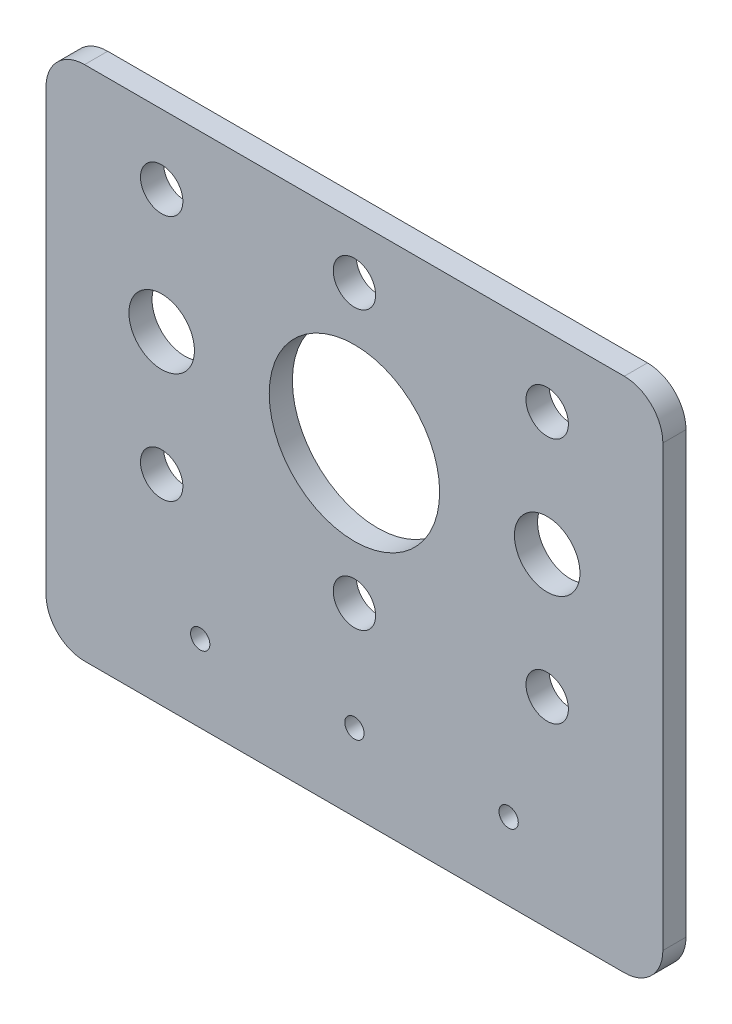
ISO-10303-21;
HEADER;
FILE_DESCRIPTION(('STEP AP214'),'2;1');
FILE_NAME('part.step','',(''),(''),'','','');
FILE_SCHEMA(('AUTOMOTIVE_DESIGN { 1 0 10303 214 1 1 1 1 }'));
ENDSEC;
DATA;
#1=APPLICATION_CONTEXT('core data for automotive mechanical design processes');
#2=APPLICATION_PROTOCOL_DEFINITION('international standard','automotive_design',2000,#1);
#3=PRODUCT_CONTEXT('',#1,'mechanical');
#4=PRODUCT('Part','Part','',(#3));
#5=PRODUCT_RELATED_PRODUCT_CATEGORY('part','',(#4));
#6=PRODUCT_DEFINITION_FORMATION('','',#4);
#7=PRODUCT_DEFINITION_CONTEXT('part definition',#1,'design');
#8=PRODUCT_DEFINITION('design','',#6,#7);
#9=PRODUCT_DEFINITION_SHAPE('','',#8);
#10=(LENGTH_UNIT() NAMED_UNIT(*) SI_UNIT(.MILLI.,.METRE.));
#11=(NAMED_UNIT(*) PLANE_ANGLE_UNIT() SI_UNIT($,.RADIAN.));
#12=(NAMED_UNIT(*) SI_UNIT($,.STERADIAN.) SOLID_ANGLE_UNIT());
#13=UNCERTAINTY_MEASURE_WITH_UNIT(LENGTH_MEASURE(1.E-05),#10,'distance_accuracy_value','');
#14=(GEOMETRIC_REPRESENTATION_CONTEXT(3) GLOBAL_UNCERTAINTY_ASSIGNED_CONTEXT((#13)) GLOBAL_UNIT_ASSIGNED_CONTEXT((#10,
#11,#12)) REPRESENTATION_CONTEXT('',''));
#15=CARTESIAN_POINT('',(0.,0.,0.));
#16=DIRECTION('',(0.,0.,1.));
#17=DIRECTION('',(1.,0.,0.));
#18=AXIS2_PLACEMENT_3D('',#15,#16,#17);
#19=CARTESIAN_POINT('',(-35.,-37.,3.));
#20=DIRECTION('',(0.,0.,1.));
#21=DIRECTION('',(1.,0.,0.));
#22=AXIS2_PLACEMENT_3D('',#19,#20,#21);
#23=PLANE('',#22);
#24=CARTESIAN_POINT('',(-25.,0.,3.));
#25=DIRECTION('',(0.,0.,1.));
#26=DIRECTION('',(1.,0.,0.));
#27=AXIS2_PLACEMENT_3D('',#24,#25,#26);
#28=CIRCLE('',#27,4.25);
#29=CARTESIAN_POINT('',(-20.75,0.,3.));
#30=VERTEX_POINT('',#29);
#31=EDGE_CURVE('E285',#30,#30,#28,.T.);
#32=ORIENTED_EDGE('',*,*,#31,.F.);
#33=EDGE_LOOP('',(#32));
#34=FACE_BOUND('',#33,.T.);
#35=CARTESIAN_POINT('',(-20.,-32.,3.));
#36=DIRECTION('',(0.,0.,1.));
#37=DIRECTION('',(1.,0.,0.));
#38=AXIS2_PLACEMENT_3D('',#35,#36,#37);
#39=CIRCLE('',#38,1.25);
#40=CARTESIAN_POINT('',(-18.75,-32.,3.));
#41=VERTEX_POINT('',#40);
#42=EDGE_CURVE('E269',#41,#41,#39,.T.);
#43=ORIENTED_EDGE('',*,*,#42,.F.);
#44=EDGE_LOOP('',(#43));
#45=FACE_BOUND('',#44,.T.);
#46=CARTESIAN_POINT('',(25.,16.,3.));
#47=DIRECTION('',(0.,0.,1.));
#48=DIRECTION('',(-1.,0.,0.));
#49=AXIS2_PLACEMENT_3D('',#46,#47,#48);
#50=CIRCLE('',#49,2.75);
#51=CARTESIAN_POINT('',(22.25,16.,3.));
#52=VERTEX_POINT('',#51);
#53=EDGE_CURVE('E253',#52,#52,#50,.T.);
#54=ORIENTED_EDGE('',*,*,#53,.F.);
#55=EDGE_LOOP('',(#54));
#56=FACE_BOUND('',#55,.T.);
#57=CARTESIAN_POINT('',(-25.,-16.,3.));
#58=DIRECTION('',(0.,0.,1.));
#59=DIRECTION('',(1.,0.,0.));
#60=AXIS2_PLACEMENT_3D('',#57,#58,#59);
#61=CIRCLE('',#60,2.75);
#62=CARTESIAN_POINT('',(-22.25,-16.,3.));
#63=VERTEX_POINT('',#62);
#64=EDGE_CURVE('E237',#63,#63,#61,.T.);
#65=ORIENTED_EDGE('',*,*,#64,.F.);
#66=EDGE_LOOP('',(#65));
#67=FACE_BOUND('',#66,.T.);
#68=CARTESIAN_POINT('',(0.,-18.,3.));
#69=DIRECTION('',(0.,0.,1.));
#70=DIRECTION('',(1.,0.,0.));
#71=AXIS2_PLACEMENT_3D('',#68,#69,#70);
#72=CIRCLE('',#71,2.75);
#73=CARTESIAN_POINT('',(2.75,-18.,3.));
#74=VERTEX_POINT('',#73);
#75=EDGE_CURVE('E221',#74,#74,#72,.T.);
#76=ORIENTED_EDGE('',*,*,#75,.F.);
#77=EDGE_LOOP('',(#76));
#78=FACE_BOUND('',#77,.T.);
#79=CARTESIAN_POINT('',(0.,0.,3.));
#80=DIRECTION('',(0.,0.,1.));
#81=DIRECTION('',(1.,0.,0.));
#82=AXIS2_PLACEMENT_3D('',#79,#80,#81);
#83=CIRCLE('',#82,11.05);
#84=CARTESIAN_POINT('',(11.05,0.,3.));
#85=VERTEX_POINT('',#84);
#86=EDGE_CURVE('E146',#85,#85,#83,.T.);
#87=ORIENTED_EDGE('',*,*,#86,.F.);
#88=EDGE_LOOP('',(#87));
#89=FACE_BOUND('',#88,.T.);
#90=CARTESIAN_POINT('',(-35.,-37.,3.));
#91=DIRECTION('',(0.,0.,1.));
#92=DIRECTION('',(1.,0.,0.));
#93=AXIS2_PLACEMENT_3D('',#90,#91,#92);
#94=CIRCLE('',#93,5.);
#95=CARTESIAN_POINT('',(-40.,-37.,3.));
#96=VERTEX_POINT('',#95);
#97=CARTESIAN_POINT('',(-35.,-42.,3.));
#98=VERTEX_POINT('',#97);
#99=EDGE_CURVE('E164',#96,#98,#94,.T.);
#100=ORIENTED_EDGE('',*,*,#99,.T.);
#101=DIRECTION('',(1.,0.,0.));
#102=VECTOR('',#101,1.);
#103=CARTESIAN_POINT('',(-35.,-42.,3.));
#104=LINE('',#103,#102);
#105=CARTESIAN_POINT('',(35.,-42.,3.));
#106=VERTEX_POINT('',#105);
#107=EDGE_CURVE('E100',#98,#106,#104,.T.);
#108=ORIENTED_EDGE('',*,*,#107,.T.);
#109=CARTESIAN_POINT('',(35.,-37.,3.));
#110=DIRECTION('',(0.,0.,1.));
#111=DIRECTION('',(1.,0.,0.));
#112=AXIS2_PLACEMENT_3D('',#109,#110,#111);
#113=CIRCLE('',#112,5.);
#114=CARTESIAN_POINT('',(40.,-37.,3.));
#115=VERTEX_POINT('',#114);
#116=EDGE_CURVE('E185',#106,#115,#113,.T.);
#117=ORIENTED_EDGE('',*,*,#116,.T.);
#118=DIRECTION('',(0.,1.,0.));
#119=VECTOR('',#118,1.);
#120=CARTESIAN_POINT('',(40.,20.,3.));
#121=LINE('',#120,#119);
#122=CARTESIAN_POINT('',(40.,20.,3.));
#123=VERTEX_POINT('',#122);
#124=EDGE_CURVE('E199',#115,#123,#121,.T.);
#125=ORIENTED_EDGE('',*,*,#124,.T.);
#126=CARTESIAN_POINT('',(35.,20.,3.));
#127=DIRECTION('',(0.,0.,1.));
#128=DIRECTION('',(1.,0.,0.));
#129=AXIS2_PLACEMENT_3D('',#126,#127,#128);
#130=CIRCLE('',#129,5.);
#131=CARTESIAN_POINT('',(35.,25.,3.));
#132=VERTEX_POINT('',#131);
#133=EDGE_CURVE('E119',#123,#132,#130,.T.);
#134=ORIENTED_EDGE('',*,*,#133,.T.);
#135=DIRECTION('',(-1.,0.,0.));
#136=VECTOR('',#135,1.);
#137=CARTESIAN_POINT('',(-35.,25.,3.));
#138=LINE('',#137,#136);
#139=CARTESIAN_POINT('',(-35.,25.,3.));
#140=VERTEX_POINT('',#139);
#141=EDGE_CURVE('E113',#132,#140,#138,.T.);
#142=ORIENTED_EDGE('',*,*,#141,.T.);
#143=CARTESIAN_POINT('',(-35.,20.,3.));
#144=DIRECTION('',(0.,0.,1.));
#145=DIRECTION('',(1.,0.,0.));
#146=AXIS2_PLACEMENT_3D('',#143,#144,#145);
#147=CIRCLE('',#146,5.);
#148=CARTESIAN_POINT('',(-40.,20.,3.));
#149=VERTEX_POINT('',#148);
#150=EDGE_CURVE('E117',#140,#149,#147,.T.);
#151=ORIENTED_EDGE('',*,*,#150,.T.);
#152=DIRECTION('',(0.,-1.,0.));
#153=VECTOR('',#152,1.);
#154=CARTESIAN_POINT('',(-40.,20.,3.));
#155=LINE('',#154,#153);
#156=EDGE_CURVE('E57',#149,#96,#155,.T.);
#157=ORIENTED_EDGE('',*,*,#156,.T.);
#158=EDGE_LOOP('',(#100,#108,#117,#125,#134,#142,#151,#157));
#159=FACE_BOUND('',#158,.T.);
#160=CARTESIAN_POINT('',(0.,18.,3.));
#161=DIRECTION('',(0.,0.,1.));
#162=DIRECTION('',(1.,0.,0.));
#163=AXIS2_PLACEMENT_3D('',#160,#161,#162);
#164=CIRCLE('',#163,2.75);
#165=CARTESIAN_POINT('',(2.75,18.,3.));
#166=VERTEX_POINT('',#165);
#167=EDGE_CURVE('E213',#166,#166,#164,.T.);
#168=ORIENTED_EDGE('',*,*,#167,.F.);
#169=EDGE_LOOP('',(#168));
#170=FACE_BOUND('',#169,.T.);
#171=CARTESIAN_POINT('',(-25.,16.,3.));
#172=DIRECTION('',(0.,0.,1.));
#173=DIRECTION('',(1.,0.,0.));
#174=AXIS2_PLACEMENT_3D('',#171,#172,#173);
#175=CIRCLE('',#174,2.75);
#176=CARTESIAN_POINT('',(-22.25,16.,3.));
#177=VERTEX_POINT('',#176);
#178=EDGE_CURVE('E229',#177,#177,#175,.T.);
#179=ORIENTED_EDGE('',*,*,#178,.F.);
#180=EDGE_LOOP('',(#179));
#181=FACE_BOUND('',#180,.T.);
#182=CARTESIAN_POINT('',(25.,-16.,3.));
#183=DIRECTION('',(0.,0.,1.));
#184=DIRECTION('',(-1.,0.,0.));
#185=AXIS2_PLACEMENT_3D('',#182,#183,#184);
#186=CIRCLE('',#185,2.75);
#187=CARTESIAN_POINT('',(22.25,-16.,3.));
#188=VERTEX_POINT('',#187);
#189=EDGE_CURVE('E245',#188,#188,#186,.T.);
#190=ORIENTED_EDGE('',*,*,#189,.F.);
#191=EDGE_LOOP('',(#190));
#192=FACE_BOUND('',#191,.T.);
#193=CARTESIAN_POINT('',(0.,-32.,3.));
#194=DIRECTION('',(0.,0.,1.));
#195=DIRECTION('',(1.,0.,0.));
#196=AXIS2_PLACEMENT_3D('',#193,#194,#195);
#197=CIRCLE('',#196,1.25);
#198=CARTESIAN_POINT('',(1.25,-32.,3.));
#199=VERTEX_POINT('',#198);
#200=EDGE_CURVE('E261',#199,#199,#197,.T.);
#201=ORIENTED_EDGE('',*,*,#200,.F.);
#202=EDGE_LOOP('',(#201));
#203=FACE_BOUND('',#202,.T.);
#204=CARTESIAN_POINT('',(20.,-32.,3.));
#205=DIRECTION('',(0.,0.,1.));
#206=DIRECTION('',(1.,0.,0.));
#207=AXIS2_PLACEMENT_3D('',#204,#205,#206);
#208=CIRCLE('',#207,1.25);
#209=CARTESIAN_POINT('',(21.25,-32.,3.));
#210=VERTEX_POINT('',#209);
#211=EDGE_CURVE('E277',#210,#210,#208,.T.);
#212=ORIENTED_EDGE('',*,*,#211,.F.);
#213=EDGE_LOOP('',(#212));
#214=FACE_BOUND('',#213,.T.);
#215=CARTESIAN_POINT('',(25.,0.,3.));
#216=DIRECTION('',(0.,0.,1.));
#217=DIRECTION('',(-1.,0.,0.));
#218=AXIS2_PLACEMENT_3D('',#215,#216,#217);
#219=CIRCLE('',#218,4.25);
#220=CARTESIAN_POINT('',(20.75,0.,3.));
#221=VERTEX_POINT('',#220);
#222=EDGE_CURVE('E293',#221,#221,#219,.T.);
#223=ORIENTED_EDGE('',*,*,#222,.F.);
#224=EDGE_LOOP('',(#223));
#225=FACE_BOUND('',#224,.T.);
#226=ADVANCED_FACE('F39',(#34,#45,#56,#67,#78,#89,#159,#170,#181,#192,#203,#214,#225),#23,.T.);
#227=CARTESIAN_POINT('',(-35.,-37.,0.));
#228=DIRECTION('',(0.,0.,1.));
#229=DIRECTION('',(1.,0.,0.));
#230=AXIS2_PLACEMENT_3D('',#227,#228,#229);
#231=PLANE('',#230);
#232=CARTESIAN_POINT('',(-35.,-37.,0.));
#233=DIRECTION('',(0.,0.,1.));
#234=DIRECTION('',(1.,0.,0.));
#235=AXIS2_PLACEMENT_3D('',#232,#233,#234);
#236=CIRCLE('',#235,5.);
#237=CARTESIAN_POINT('',(-40.,-37.,0.));
#238=VERTEX_POINT('',#237);
#239=CARTESIAN_POINT('',(-35.,-42.,0.));
#240=VERTEX_POINT('',#239);
#241=EDGE_CURVE('E141',#238,#240,#236,.T.);
#242=ORIENTED_EDGE('',*,*,#241,.F.);
#243=DIRECTION('',(0.,-1.,0.));
#244=VECTOR('',#243,1.);
#245=CARTESIAN_POINT('',(-40.,20.,0.));
#246=LINE('',#245,#244);
#247=CARTESIAN_POINT('',(-40.,20.,0.));
#248=VERTEX_POINT('',#247);
#249=EDGE_CURVE('E92',#248,#238,#246,.T.);
#250=ORIENTED_EDGE('',*,*,#249,.F.);
#251=CARTESIAN_POINT('',(-35.,20.,0.));
#252=DIRECTION('',(0.,0.,1.));
#253=DIRECTION('',(1.,0.,0.));
#254=AXIS2_PLACEMENT_3D('',#251,#252,#253);
#255=CIRCLE('',#254,5.);
#256=CARTESIAN_POINT('',(-35.,25.,0.));
#257=VERTEX_POINT('',#256);
#258=EDGE_CURVE('E86',#257,#248,#255,.T.);
#259=ORIENTED_EDGE('',*,*,#258,.F.);
#260=DIRECTION('',(-1.,0.,0.));
#261=VECTOR('',#260,1.);
#262=CARTESIAN_POINT('',(-35.,25.,0.));
#263=LINE('',#262,#261);
#264=CARTESIAN_POINT('',(35.,25.,0.));
#265=VERTEX_POINT('',#264);
#266=EDGE_CURVE('E128',#265,#257,#263,.T.);
#267=ORIENTED_EDGE('',*,*,#266,.F.);
#268=CARTESIAN_POINT('',(35.,20.,0.));
#269=DIRECTION('',(0.,0.,1.));
#270=DIRECTION('',(1.,0.,0.));
#271=AXIS2_PLACEMENT_3D('',#268,#269,#270);
#272=CIRCLE('',#271,5.);
#273=CARTESIAN_POINT('',(40.,20.,0.));
#274=VERTEX_POINT('',#273);
#275=EDGE_CURVE('E155',#274,#265,#272,.T.);
#276=ORIENTED_EDGE('',*,*,#275,.F.);
#277=DIRECTION('',(0.,1.,0.));
#278=VECTOR('',#277,1.);
#279=CARTESIAN_POINT('',(40.,20.,0.));
#280=LINE('',#279,#278);
#281=CARTESIAN_POINT('',(40.,-37.,0.));
#282=VERTEX_POINT('',#281);
#283=EDGE_CURVE('E152',#282,#274,#280,.T.);
#284=ORIENTED_EDGE('',*,*,#283,.F.);
#285=CARTESIAN_POINT('',(35.,-37.,0.));
#286=DIRECTION('',(0.,0.,1.));
#287=DIRECTION('',(1.,0.,0.));
#288=AXIS2_PLACEMENT_3D('',#285,#286,#287);
#289=CIRCLE('',#288,5.);
#290=CARTESIAN_POINT('',(35.,-42.,0.));
#291=VERTEX_POINT('',#290);
#292=EDGE_CURVE('E149',#291,#282,#289,.T.);
#293=ORIENTED_EDGE('',*,*,#292,.F.);
#294=DIRECTION('',(1.,0.,0.));
#295=VECTOR('',#294,1.);
#296=CARTESIAN_POINT('',(-35.,-42.,0.));
#297=LINE('',#296,#295);
#298=EDGE_CURVE('E145',#240,#291,#297,.T.);
#299=ORIENTED_EDGE('',*,*,#298,.F.);
#300=EDGE_LOOP('',(#242,#250,#259,#267,#276,#284,#293,#299));
#301=FACE_BOUND('',#300,.T.);
#302=CARTESIAN_POINT('',(0.,0.,0.));
#303=DIRECTION('',(0.,0.,1.));
#304=DIRECTION('',(1.,0.,0.));
#305=AXIS2_PLACEMENT_3D('',#302,#303,#304);
#306=CIRCLE('',#305,11.05);
#307=CARTESIAN_POINT('',(11.05,0.,0.));
#308=VERTEX_POINT('',#307);
#309=EDGE_CURVE('E209',#308,#308,#306,.T.);
#310=ORIENTED_EDGE('',*,*,#309,.T.);
#311=EDGE_LOOP('',(#310));
#312=FACE_BOUND('',#311,.T.);
#313=CARTESIAN_POINT('',(0.,18.,0.));
#314=DIRECTION('',(0.,0.,1.));
#315=DIRECTION('',(1.,0.,0.));
#316=AXIS2_PLACEMENT_3D('',#313,#314,#315);
#317=CIRCLE('',#316,2.75);
#318=CARTESIAN_POINT('',(2.75,18.,0.));
#319=VERTEX_POINT('',#318);
#320=EDGE_CURVE('E217',#319,#319,#317,.T.);
#321=ORIENTED_EDGE('',*,*,#320,.T.);
#322=EDGE_LOOP('',(#321));
#323=FACE_BOUND('',#322,.T.);
#324=CARTESIAN_POINT('',(0.,-18.,0.));
#325=DIRECTION('',(0.,0.,1.));
#326=DIRECTION('',(1.,0.,0.));
#327=AXIS2_PLACEMENT_3D('',#324,#325,#326);
#328=CIRCLE('',#327,2.75);
#329=CARTESIAN_POINT('',(2.75,-18.,0.));
#330=VERTEX_POINT('',#329);
#331=EDGE_CURVE('E225',#330,#330,#328,.T.);
#332=ORIENTED_EDGE('',*,*,#331,.T.);
#333=EDGE_LOOP('',(#332));
#334=FACE_BOUND('',#333,.T.);
#335=CARTESIAN_POINT('',(-25.,16.,0.));
#336=DIRECTION('',(0.,0.,1.));
#337=DIRECTION('',(1.,0.,0.));
#338=AXIS2_PLACEMENT_3D('',#335,#336,#337);
#339=CIRCLE('',#338,2.75);
#340=CARTESIAN_POINT('',(-22.25,16.,0.));
#341=VERTEX_POINT('',#340);
#342=EDGE_CURVE('E233',#341,#341,#339,.T.);
#343=ORIENTED_EDGE('',*,*,#342,.T.);
#344=EDGE_LOOP('',(#343));
#345=FACE_BOUND('',#344,.T.);
#346=CARTESIAN_POINT('',(-25.,-16.,0.));
#347=DIRECTION('',(0.,0.,1.));
#348=DIRECTION('',(1.,0.,0.));
#349=AXIS2_PLACEMENT_3D('',#346,#347,#348);
#350=CIRCLE('',#349,2.75);
#351=CARTESIAN_POINT('',(-22.25,-16.,0.));
#352=VERTEX_POINT('',#351);
#353=EDGE_CURVE('E241',#352,#352,#350,.T.);
#354=ORIENTED_EDGE('',*,*,#353,.T.);
#355=EDGE_LOOP('',(#354));
#356=FACE_BOUND('',#355,.T.);
#357=CARTESIAN_POINT('',(25.,-16.,0.));
#358=DIRECTION('',(0.,0.,1.));
#359=DIRECTION('',(-1.,0.,0.));
#360=AXIS2_PLACEMENT_3D('',#357,#358,#359);
#361=CIRCLE('',#360,2.75);
#362=CARTESIAN_POINT('',(22.25,-16.,0.));
#363=VERTEX_POINT('',#362);
#364=EDGE_CURVE('E249',#363,#363,#361,.T.);
#365=ORIENTED_EDGE('',*,*,#364,.T.);
#366=EDGE_LOOP('',(#365));
#367=FACE_BOUND('',#366,.T.);
#368=CARTESIAN_POINT('',(25.,16.,0.));
#369=DIRECTION('',(0.,0.,1.));
#370=DIRECTION('',(-1.,0.,0.));
#371=AXIS2_PLACEMENT_3D('',#368,#369,#370);
#372=CIRCLE('',#371,2.75);
#373=CARTESIAN_POINT('',(22.25,16.,0.));
#374=VERTEX_POINT('',#373);
#375=EDGE_CURVE('E257',#374,#374,#372,.T.);
#376=ORIENTED_EDGE('',*,*,#375,.T.);
#377=EDGE_LOOP('',(#376));
#378=FACE_BOUND('',#377,.T.);
#379=CARTESIAN_POINT('',(0.,-32.,0.));
#380=DIRECTION('',(0.,0.,1.));
#381=DIRECTION('',(1.,0.,0.));
#382=AXIS2_PLACEMENT_3D('',#379,#380,#381);
#383=CIRCLE('',#382,1.25);
#384=CARTESIAN_POINT('',(1.25,-32.,0.));
#385=VERTEX_POINT('',#384);
#386=EDGE_CURVE('E265',#385,#385,#383,.T.);
#387=ORIENTED_EDGE('',*,*,#386,.T.);
#388=EDGE_LOOP('',(#387));
#389=FACE_BOUND('',#388,.T.);
#390=CARTESIAN_POINT('',(-20.,-32.,0.));
#391=DIRECTION('',(0.,0.,1.));
#392=DIRECTION('',(1.,0.,0.));
#393=AXIS2_PLACEMENT_3D('',#390,#391,#392);
#394=CIRCLE('',#393,1.25);
#395=CARTESIAN_POINT('',(-18.75,-32.,0.));
#396=VERTEX_POINT('',#395);
#397=EDGE_CURVE('E273',#396,#396,#394,.T.);
#398=ORIENTED_EDGE('',*,*,#397,.T.);
#399=EDGE_LOOP('',(#398));
#400=FACE_BOUND('',#399,.T.);
#401=CARTESIAN_POINT('',(20.,-32.,0.));
#402=DIRECTION('',(0.,0.,1.));
#403=DIRECTION('',(1.,0.,0.));
#404=AXIS2_PLACEMENT_3D('',#401,#402,#403);
#405=CIRCLE('',#404,1.25);
#406=CARTESIAN_POINT('',(21.25,-32.,0.));
#407=VERTEX_POINT('',#406);
#408=EDGE_CURVE('E281',#407,#407,#405,.T.);
#409=ORIENTED_EDGE('',*,*,#408,.T.);
#410=EDGE_LOOP('',(#409));
#411=FACE_BOUND('',#410,.T.);
#412=CARTESIAN_POINT('',(-25.,0.,0.));
#413=DIRECTION('',(0.,0.,1.));
#414=DIRECTION('',(1.,0.,0.));
#415=AXIS2_PLACEMENT_3D('',#412,#413,#414);
#416=CIRCLE('',#415,4.25);
#417=CARTESIAN_POINT('',(-20.75,0.,0.));
#418=VERTEX_POINT('',#417);
#419=EDGE_CURVE('E289',#418,#418,#416,.T.);
#420=ORIENTED_EDGE('',*,*,#419,.T.);
#421=EDGE_LOOP('',(#420));
#422=FACE_BOUND('',#421,.T.);
#423=CARTESIAN_POINT('',(25.,0.,0.));
#424=DIRECTION('',(0.,0.,1.));
#425=DIRECTION('',(-1.,0.,0.));
#426=AXIS2_PLACEMENT_3D('',#423,#424,#425);
#427=CIRCLE('',#426,4.25);
#428=CARTESIAN_POINT('',(20.75,0.,0.));
#429=VERTEX_POINT('',#428);
#430=EDGE_CURVE('E297',#429,#429,#427,.T.);
#431=ORIENTED_EDGE('',*,*,#430,.T.);
#432=EDGE_LOOP('',(#431));
#433=FACE_BOUND('',#432,.T.);
#434=ADVANCED_FACE('F189',(#301,#312,#323,#334,#345,#356,#367,#378,#389,#400,#411,#422,#433),
#231,.F.);
#435=CARTESIAN_POINT('',(-35.,-37.,3.));
#436=DIRECTION('',(0.,0.,-1.));
#437=DIRECTION('',(-1.,0.,0.));
#438=AXIS2_PLACEMENT_3D('',#435,#436,#437);
#439=CYLINDRICAL_SURFACE('',#438,5.);
#440=ORIENTED_EDGE('',*,*,#241,.T.);
#441=DIRECTION('',(0.,0.,-1.));
#442=VECTOR('',#441,1.);
#443=CARTESIAN_POINT('',(-35.,-42.,3.));
#444=LINE('',#443,#442);
#445=EDGE_CURVE('E11',#98,#240,#444,.T.);
#446=ORIENTED_EDGE('',*,*,#445,.F.);
#447=ORIENTED_EDGE('',*,*,#99,.F.);
#448=DIRECTION('',(0.,0.,-1.));
#449=VECTOR('',#448,1.);
#450=CARTESIAN_POINT('',(-40.,-37.,3.));
#451=LINE('',#450,#449);
#452=EDGE_CURVE('E137',#96,#238,#451,.T.);
#453=ORIENTED_EDGE('',*,*,#452,.T.);
#454=EDGE_LOOP('',(#440,#446,#447,#453));
#455=FACE_BOUND('',#454,.T.);
#456=ADVANCED_FACE('F41',(#455),#439,.T.);
#457=CARTESIAN_POINT('',(-35.,-42.,3.));
#458=DIRECTION('',(0.,1.,0.));
#459=DIRECTION('',(0.,0.,1.));
#460=AXIS2_PLACEMENT_3D('',#457,#458,#459);
#461=PLANE('',#460);
#462=ORIENTED_EDGE('',*,*,#298,.T.);
#463=DIRECTION('',(0.,0.,-1.));
#464=VECTOR('',#463,1.);
#465=CARTESIAN_POINT('',(35.,-42.,3.));
#466=LINE('',#465,#464);
#467=EDGE_CURVE('E49',#106,#291,#466,.T.);
#468=ORIENTED_EDGE('',*,*,#467,.F.);
#469=ORIENTED_EDGE('',*,*,#107,.F.);
#470=ORIENTED_EDGE('',*,*,#445,.T.);
#471=EDGE_LOOP('',(#462,#468,#469,#470));
#472=FACE_BOUND('',#471,.T.);
#473=ADVANCED_FACE('F333',(#472),#461,.F.);
#474=CARTESIAN_POINT('',(35.,-37.,3.));
#475=DIRECTION('',(0.,0.,-1.));
#476=DIRECTION('',(-1.,0.,0.));
#477=AXIS2_PLACEMENT_3D('',#474,#475,#476);
#478=CYLINDRICAL_SURFACE('',#477,5.);
#479=ORIENTED_EDGE('',*,*,#292,.T.);
#480=DIRECTION('',(0.,0.,-1.));
#481=VECTOR('',#480,1.);
#482=CARTESIAN_POINT('',(40.,-37.,3.));
#483=LINE('',#482,#481);
#484=EDGE_CURVE('E175',#115,#282,#483,.T.);
#485=ORIENTED_EDGE('',*,*,#484,.F.);
#486=ORIENTED_EDGE('',*,*,#116,.F.);
#487=ORIENTED_EDGE('',*,*,#467,.T.);
#488=EDGE_LOOP('',(#479,#485,#486,#487));
#489=FACE_BOUND('',#488,.T.);
#490=ADVANCED_FACE('F183',(#489),#478,.T.);
#491=CARTESIAN_POINT('',(40.,20.,3.));
#492=DIRECTION('',(-1.,0.,0.));
#493=DIRECTION('',(0.,0.,1.));
#494=AXIS2_PLACEMENT_3D('',#491,#492,#493);
#495=PLANE('',#494);
#496=ORIENTED_EDGE('',*,*,#283,.T.);
#497=DIRECTION('',(0.,0.,-1.));
#498=VECTOR('',#497,1.);
#499=CARTESIAN_POINT('',(40.,20.,3.));
#500=LINE('',#499,#498);
#501=EDGE_CURVE('E171',#123,#274,#500,.T.);
#502=ORIENTED_EDGE('',*,*,#501,.F.);
#503=ORIENTED_EDGE('',*,*,#124,.F.);
#504=ORIENTED_EDGE('',*,*,#484,.T.);
#505=EDGE_LOOP('',(#496,#502,#503,#504));
#506=FACE_BOUND('',#505,.T.);
#507=ADVANCED_FACE('F194',(#506),#495,.F.);
#508=CARTESIAN_POINT('',(35.,20.,3.));
#509=DIRECTION('',(0.,0.,-1.));
#510=DIRECTION('',(-1.,0.,0.));
#511=AXIS2_PLACEMENT_3D('',#508,#509,#510);
#512=CYLINDRICAL_SURFACE('',#511,5.);
#513=ORIENTED_EDGE('',*,*,#275,.T.);
#514=DIRECTION('',(0.,0.,-1.));
#515=VECTOR('',#514,1.);
#516=CARTESIAN_POINT('',(35.,25.,3.));
#517=LINE('',#516,#515);
#518=EDGE_CURVE('E130',#132,#265,#517,.T.);
#519=ORIENTED_EDGE('',*,*,#518,.F.);
#520=ORIENTED_EDGE('',*,*,#133,.F.);
#521=ORIENTED_EDGE('',*,*,#501,.T.);
#522=EDGE_LOOP('',(#513,#519,#520,#521));
#523=FACE_BOUND('',#522,.T.);
#524=ADVANCED_FACE('F197',(#523),#512,.T.);
#525=CARTESIAN_POINT('',(-35.,25.,3.));
#526=DIRECTION('',(0.,-1.,0.));
#527=DIRECTION('',(0.,0.,-1.));
#528=AXIS2_PLACEMENT_3D('',#525,#526,#527);
#529=PLANE('',#528);
#530=ORIENTED_EDGE('',*,*,#266,.T.);
#531=DIRECTION('',(0.,0.,-1.));
#532=VECTOR('',#531,1.);
#533=CARTESIAN_POINT('',(-35.,25.,3.));
#534=LINE('',#533,#532);
#535=EDGE_CURVE('E125',#140,#257,#534,.T.);
#536=ORIENTED_EDGE('',*,*,#535,.F.);
#537=ORIENTED_EDGE('',*,*,#141,.F.);
#538=ORIENTED_EDGE('',*,*,#518,.T.);
#539=EDGE_LOOP('',(#530,#536,#537,#538));
#540=FACE_BOUND('',#539,.T.);
#541=ADVANCED_FACE('F126',(#540),#529,.F.);
#542=CARTESIAN_POINT('',(-35.,20.,3.));
#543=DIRECTION('',(0.,0.,-1.));
#544=DIRECTION('',(-1.,0.,0.));
#545=AXIS2_PLACEMENT_3D('',#542,#543,#544);
#546=CYLINDRICAL_SURFACE('',#545,5.);
#547=ORIENTED_EDGE('',*,*,#258,.T.);
#548=DIRECTION('',(0.,0.,-1.));
#549=VECTOR('',#548,1.);
#550=CARTESIAN_POINT('',(-40.,20.,3.));
#551=LINE('',#550,#549);
#552=EDGE_CURVE('E131',#149,#248,#551,.T.);
#553=ORIENTED_EDGE('',*,*,#552,.F.);
#554=ORIENTED_EDGE('',*,*,#150,.F.);
#555=ORIENTED_EDGE('',*,*,#535,.T.);
#556=EDGE_LOOP('',(#547,#553,#554,#555));
#557=FACE_BOUND('',#556,.T.);
#558=ADVANCED_FACE('F133',(#557),#546,.T.);
#559=CARTESIAN_POINT('',(-40.,20.,3.));
#560=DIRECTION('',(1.,0.,0.));
#561=DIRECTION('',(0.,0.,-1.));
#562=AXIS2_PLACEMENT_3D('',#559,#560,#561);
#563=PLANE('',#562);
#564=ORIENTED_EDGE('',*,*,#249,.T.);
#565=ORIENTED_EDGE('',*,*,#452,.F.);
#566=ORIENTED_EDGE('',*,*,#156,.F.);
#567=ORIENTED_EDGE('',*,*,#552,.T.);
#568=EDGE_LOOP('',(#564,#565,#566,#567));
#569=FACE_BOUND('',#568,.T.);
#570=ADVANCED_FACE('F321',(#569),#563,.F.);
#571=CARTESIAN_POINT('',(0.,0.,3.));
#572=DIRECTION('',(0.,0.,-1.));
#573=DIRECTION('',(-1.,0.,0.));
#574=AXIS2_PLACEMENT_3D('',#571,#572,#573);
#575=CYLINDRICAL_SURFACE('',#574,11.05);
#576=ORIENTED_EDGE('',*,*,#86,.T.);
#577=EDGE_LOOP('',(#576));
#578=FACE_BOUND('',#577,.T.);
#579=ORIENTED_EDGE('',*,*,#309,.F.);
#580=EDGE_LOOP('',(#579));
#581=FACE_BOUND('',#580,.T.);
#582=ADVANCED_FACE('F318',(#578,#581),#575,.F.);
#583=CARTESIAN_POINT('',(0.,18.,3.));
#584=DIRECTION('',(0.,0.,-1.));
#585=DIRECTION('',(-1.,0.,0.));
#586=AXIS2_PLACEMENT_3D('',#583,#584,#585);
#587=CYLINDRICAL_SURFACE('',#586,2.75);
#588=ORIENTED_EDGE('',*,*,#167,.T.);
#589=EDGE_LOOP('',(#588));
#590=FACE_BOUND('',#589,.T.);
#591=ORIENTED_EDGE('',*,*,#320,.F.);
#592=EDGE_LOOP('',(#591));
#593=FACE_BOUND('',#592,.T.);
#594=ADVANCED_FACE('F397',(#590,#593),#587,.F.);
#595=CARTESIAN_POINT('',(0.,-18.,3.));
#596=DIRECTION('',(0.,0.,-1.));
#597=DIRECTION('',(-1.,0.,0.));
#598=AXIS2_PLACEMENT_3D('',#595,#596,#597);
#599=CYLINDRICAL_SURFACE('',#598,2.75);
#600=ORIENTED_EDGE('',*,*,#75,.T.);
#601=EDGE_LOOP('',(#600));
#602=FACE_BOUND('',#601,.T.);
#603=ORIENTED_EDGE('',*,*,#331,.F.);
#604=EDGE_LOOP('',(#603));
#605=FACE_BOUND('',#604,.T.);
#606=ADVANCED_FACE('F405',(#602,#605),#599,.F.);
#607=CARTESIAN_POINT('',(-25.,16.,3.));
#608=DIRECTION('',(0.,0.,-1.));
#609=DIRECTION('',(-1.,0.,0.));
#610=AXIS2_PLACEMENT_3D('',#607,#608,#609);
#611=CYLINDRICAL_SURFACE('',#610,2.75);
#612=ORIENTED_EDGE('',*,*,#178,.T.);
#613=EDGE_LOOP('',(#612));
#614=FACE_BOUND('',#613,.T.);
#615=ORIENTED_EDGE('',*,*,#342,.F.);
#616=EDGE_LOOP('',(#615));
#617=FACE_BOUND('',#616,.T.);
#618=ADVANCED_FACE('F413',(#614,#617),#611,.F.);
#619=CARTESIAN_POINT('',(-25.,-16.,3.));
#620=DIRECTION('',(0.,0.,-1.));
#621=DIRECTION('',(-1.,0.,0.));
#622=AXIS2_PLACEMENT_3D('',#619,#620,#621);
#623=CYLINDRICAL_SURFACE('',#622,2.75);
#624=ORIENTED_EDGE('',*,*,#64,.T.);
#625=EDGE_LOOP('',(#624));
#626=FACE_BOUND('',#625,.T.);
#627=ORIENTED_EDGE('',*,*,#353,.F.);
#628=EDGE_LOOP('',(#627));
#629=FACE_BOUND('',#628,.T.);
#630=ADVANCED_FACE('F422',(#626,#629),#623,.F.);
#631=CARTESIAN_POINT('',(25.,-16.,3.));
#632=DIRECTION('',(0.,0.,-1.));
#633=DIRECTION('',(-1.,0.,0.));
#634=AXIS2_PLACEMENT_3D('',#631,#632,#633);
#635=CYLINDRICAL_SURFACE('',#634,2.75);
#636=ORIENTED_EDGE('',*,*,#189,.T.);
#637=EDGE_LOOP('',(#636));
#638=FACE_BOUND('',#637,.T.);
#639=ORIENTED_EDGE('',*,*,#364,.F.);
#640=EDGE_LOOP('',(#639));
#641=FACE_BOUND('',#640,.T.);
#642=ADVANCED_FACE('F431',(#638,#641),#635,.F.);
#643=CARTESIAN_POINT('',(25.,16.,3.));
#644=DIRECTION('',(0.,0.,-1.));
#645=DIRECTION('',(-1.,0.,0.));
#646=AXIS2_PLACEMENT_3D('',#643,#644,#645);
#647=CYLINDRICAL_SURFACE('',#646,2.75);
#648=ORIENTED_EDGE('',*,*,#53,.T.);
#649=EDGE_LOOP('',(#648));
#650=FACE_BOUND('',#649,.T.);
#651=ORIENTED_EDGE('',*,*,#375,.F.);
#652=EDGE_LOOP('',(#651));
#653=FACE_BOUND('',#652,.T.);
#654=ADVANCED_FACE('F440',(#650,#653),#647,.F.);
#655=CARTESIAN_POINT('',(0.,-32.,3.));
#656=DIRECTION('',(0.,0.,-1.));
#657=DIRECTION('',(-1.,0.,0.));
#658=AXIS2_PLACEMENT_3D('',#655,#656,#657);
#659=CYLINDRICAL_SURFACE('',#658,1.25);
#660=ORIENTED_EDGE('',*,*,#200,.T.);
#661=EDGE_LOOP('',(#660));
#662=FACE_BOUND('',#661,.T.);
#663=ORIENTED_EDGE('',*,*,#386,.F.);
#664=EDGE_LOOP('',(#663));
#665=FACE_BOUND('',#664,.T.);
#666=ADVANCED_FACE('F449',(#662,#665),#659,.F.);
#667=CARTESIAN_POINT('',(-20.,-32.,3.));
#668=DIRECTION('',(0.,0.,-1.));
#669=DIRECTION('',(-1.,0.,0.));
#670=AXIS2_PLACEMENT_3D('',#667,#668,#669);
#671=CYLINDRICAL_SURFACE('',#670,1.25);
#672=ORIENTED_EDGE('',*,*,#42,.T.);
#673=EDGE_LOOP('',(#672));
#674=FACE_BOUND('',#673,.T.);
#675=ORIENTED_EDGE('',*,*,#397,.F.);
#676=EDGE_LOOP('',(#675));
#677=FACE_BOUND('',#676,.T.);
#678=ADVANCED_FACE('F458',(#674,#677),#671,.F.);
#679=CARTESIAN_POINT('',(20.,-32.,3.));
#680=DIRECTION('',(0.,0.,-1.));
#681=DIRECTION('',(-1.,0.,0.));
#682=AXIS2_PLACEMENT_3D('',#679,#680,#681);
#683=CYLINDRICAL_SURFACE('',#682,1.25);
#684=ORIENTED_EDGE('',*,*,#211,.T.);
#685=EDGE_LOOP('',(#684));
#686=FACE_BOUND('',#685,.T.);
#687=ORIENTED_EDGE('',*,*,#408,.F.);
#688=EDGE_LOOP('',(#687));
#689=FACE_BOUND('',#688,.T.);
#690=ADVANCED_FACE('F467',(#686,#689),#683,.F.);
#691=CARTESIAN_POINT('',(-25.,0.,3.));
#692=DIRECTION('',(0.,0.,-1.));
#693=DIRECTION('',(-1.,0.,0.));
#694=AXIS2_PLACEMENT_3D('',#691,#692,#693);
#695=CYLINDRICAL_SURFACE('',#694,4.25);
#696=ORIENTED_EDGE('',*,*,#31,.T.);
#697=EDGE_LOOP('',(#696));
#698=FACE_BOUND('',#697,.T.);
#699=ORIENTED_EDGE('',*,*,#419,.F.);
#700=EDGE_LOOP('',(#699));
#701=FACE_BOUND('',#700,.T.);
#702=ADVANCED_FACE('F476',(#698,#701),#695,.F.);
#703=CARTESIAN_POINT('',(25.,0.,3.));
#704=DIRECTION('',(0.,0.,-1.));
#705=DIRECTION('',(-1.,0.,0.));
#706=AXIS2_PLACEMENT_3D('',#703,#704,#705);
#707=CYLINDRICAL_SURFACE('',#706,4.25);
#708=ORIENTED_EDGE('',*,*,#222,.T.);
#709=EDGE_LOOP('',(#708));
#710=FACE_BOUND('',#709,.T.);
#711=ORIENTED_EDGE('',*,*,#430,.F.);
#712=EDGE_LOOP('',(#711));
#713=FACE_BOUND('',#712,.T.);
#714=ADVANCED_FACE('F305',(#710,#713),#707,.F.);
#715=CLOSED_SHELL('',(#226,#434,#456,#473,#490,#507,#524,#541,#558,#570,#582,#594,#606,#618,
#630,#642,#654,#666,#678,#690,#702,#714));
#716=MANIFOLD_SOLID_BREP('B2',#715);
#717=ADVANCED_BREP_SHAPE_REPRESENTATION('',(#18,#716),#14);
#718=SHAPE_DEFINITION_REPRESENTATION(#9,#717);
ENDSEC;
END-ISO-10303-21;
